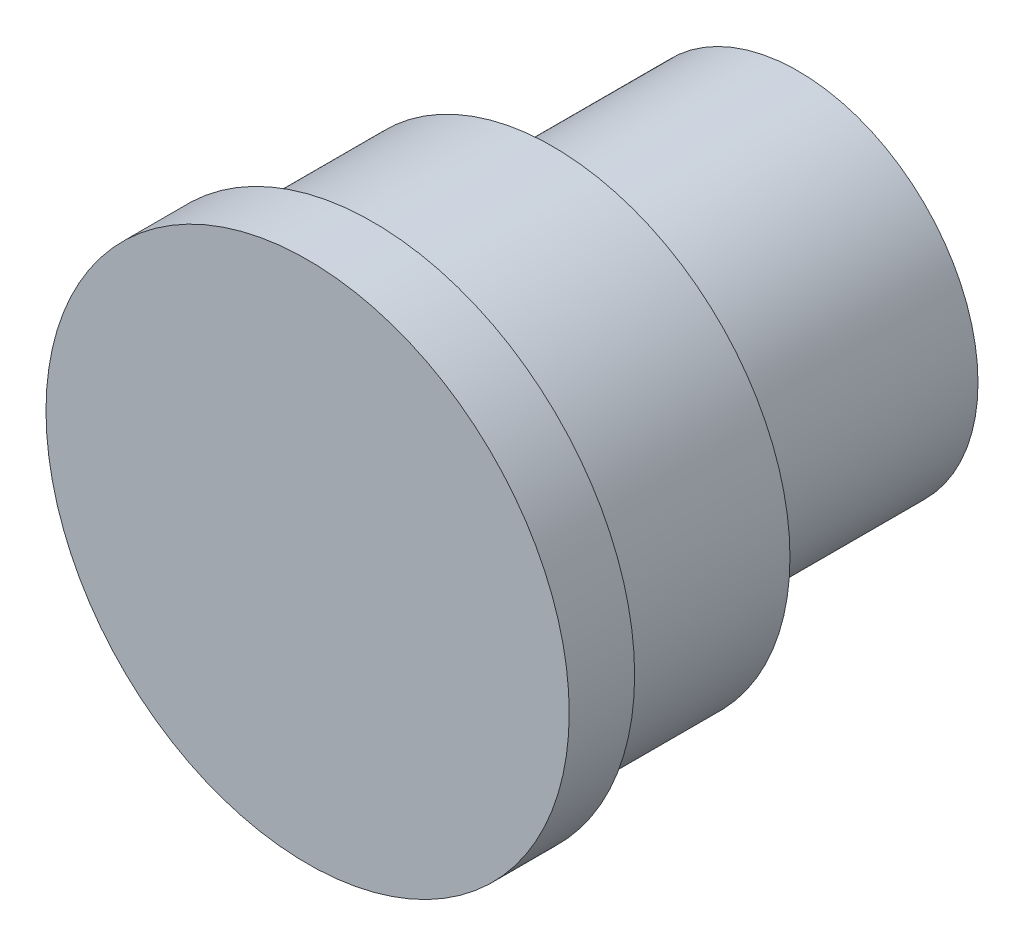
ISO-10303-21;
HEADER;
FILE_DESCRIPTION(('STEP AP214'),'2;1');
FILE_NAME('part.step','',(''),(''),'','','');
FILE_SCHEMA(('AUTOMOTIVE_DESIGN { 1 0 10303 214 1 1 1 1 }'));
ENDSEC;
DATA;
#1=APPLICATION_CONTEXT('core data for automotive mechanical design processes');
#2=APPLICATION_PROTOCOL_DEFINITION('international standard','automotive_design',2000,#1);
#3=PRODUCT_CONTEXT('',#1,'mechanical');
#4=PRODUCT('Part','Part','',(#3));
#5=PRODUCT_RELATED_PRODUCT_CATEGORY('part','',(#4));
#6=PRODUCT_DEFINITION_FORMATION('','',#4);
#7=PRODUCT_DEFINITION_CONTEXT('part definition',#1,'design');
#8=PRODUCT_DEFINITION('design','',#6,#7);
#9=PRODUCT_DEFINITION_SHAPE('','',#8);
#10=(LENGTH_UNIT() NAMED_UNIT(*) SI_UNIT(.MILLI.,.METRE.));
#11=(NAMED_UNIT(*) PLANE_ANGLE_UNIT() SI_UNIT($,.RADIAN.));
#12=(NAMED_UNIT(*) SI_UNIT($,.STERADIAN.) SOLID_ANGLE_UNIT());
#13=UNCERTAINTY_MEASURE_WITH_UNIT(LENGTH_MEASURE(1.E-05),#10,'distance_accuracy_value','');
#14=(GEOMETRIC_REPRESENTATION_CONTEXT(3) GLOBAL_UNCERTAINTY_ASSIGNED_CONTEXT((#13)) GLOBAL_UNIT_ASSIGNED_CONTEXT((#10,
#11,#12)) REPRESENTATION_CONTEXT('',''));
#15=CARTESIAN_POINT('',(0.,0.,0.));
#16=DIRECTION('',(0.,0.,1.));
#17=DIRECTION('',(1.,0.,0.));
#18=AXIS2_PLACEMENT_3D('',#15,#16,#17);
#19=CARTESIAN_POINT('',(0.,0.,15.));
#20=DIRECTION('',(0.,0.,-1.));
#21=DIRECTION('',(-1.,0.,0.));
#22=AXIS2_PLACEMENT_3D('',#19,#20,#21);
#23=CYLINDRICAL_SURFACE('',#22,11.);
#24=CARTESIAN_POINT('',(0.,0.,15.));
#25=DIRECTION('',(0.,0.,1.));
#26=DIRECTION('',(1.,0.,0.));
#27=AXIS2_PLACEMENT_3D('',#24,#25,#26);
#28=CIRCLE('',#27,11.);
#29=CARTESIAN_POINT('',(11.,0.,15.));
#30=VERTEX_POINT('',#29);
#31=EDGE_CURVE('E10',#30,#30,#28,.T.);
#32=ORIENTED_EDGE('',*,*,#31,.F.);
#33=EDGE_LOOP('',(#32));
#34=FACE_BOUND('',#33,.T.);
#35=CARTESIAN_POINT('',(0.,0.,0.));
#36=DIRECTION('',(0.,0.,1.));
#37=DIRECTION('',(1.,0.,0.));
#38=AXIS2_PLACEMENT_3D('',#35,#36,#37);
#39=CIRCLE('',#38,11.);
#40=CARTESIAN_POINT('',(11.,0.,0.));
#41=VERTEX_POINT('',#40);
#42=EDGE_CURVE('E38',#41,#41,#39,.T.);
#43=ORIENTED_EDGE('',*,*,#42,.T.);
#44=EDGE_LOOP('',(#43));
#45=FACE_BOUND('',#44,.T.);
#46=ADVANCED_FACE('F35',(#34,#45),#23,.T.);
#47=CARTESIAN_POINT('',(0.,0.,0.));
#48=DIRECTION('',(0.,0.,1.));
#49=DIRECTION('',(1.,0.,0.));
#50=AXIS2_PLACEMENT_3D('',#47,#48,#49);
#51=PLANE('',#50);
#52=ORIENTED_EDGE('',*,*,#42,.F.);
#53=EDGE_LOOP('',(#52));
#54=FACE_BOUND('',#53,.T.);
#55=ADVANCED_FACE('F77',(#54),#51,.F.);
#56=CARTESIAN_POINT('',(0.,0.,26.));
#57=DIRECTION('',(0.,0.,-1.));
#58=DIRECTION('',(-1.,0.,0.));
#59=AXIS2_PLACEMENT_3D('',#56,#57,#58);
#60=CYLINDRICAL_SURFACE('',#59,14.5);
#61=CARTESIAN_POINT('',(0.,0.,26.));
#62=DIRECTION('',(0.,0.,1.));
#63=DIRECTION('',(1.,0.,0.));
#64=AXIS2_PLACEMENT_3D('',#61,#62,#63);
#65=CIRCLE('',#64,14.5);
#66=CARTESIAN_POINT('',(14.5,0.,26.));
#67=VERTEX_POINT('',#66);
#68=EDGE_CURVE('E45',#67,#67,#65,.T.);
#69=ORIENTED_EDGE('',*,*,#68,.F.);
#70=EDGE_LOOP('',(#69));
#71=FACE_BOUND('',#70,.T.);
#72=CARTESIAN_POINT('',(0.,0.,15.));
#73=DIRECTION('',(0.,0.,1.));
#74=DIRECTION('',(1.,0.,0.));
#75=AXIS2_PLACEMENT_3D('',#72,#73,#74);
#76=CIRCLE('',#75,14.5);
#77=CARTESIAN_POINT('',(14.5,0.,15.));
#78=VERTEX_POINT('',#77);
#79=EDGE_CURVE('E47',#78,#78,#76,.T.);
#80=ORIENTED_EDGE('',*,*,#79,.T.);
#81=EDGE_LOOP('',(#80));
#82=FACE_BOUND('',#81,.T.);
#83=ADVANCED_FACE('F82',(#71,#82),#60,.T.);
#84=CARTESIAN_POINT('',(0.,0.,15.));
#85=DIRECTION('',(0.,0.,1.));
#86=DIRECTION('',(1.,0.,0.));
#87=AXIS2_PLACEMENT_3D('',#84,#85,#86);
#88=PLANE('',#87);
#89=ORIENTED_EDGE('',*,*,#31,.T.);
#90=EDGE_LOOP('',(#89));
#91=FACE_BOUND('',#90,.T.);
#92=ORIENTED_EDGE('',*,*,#79,.F.);
#93=EDGE_LOOP('',(#92));
#94=FACE_BOUND('',#93,.T.);
#95=ADVANCED_FACE('F64',(#91,#94),#88,.F.);
#96=CARTESIAN_POINT('',(0.,0.,30.));
#97=DIRECTION('',(0.,0.,-1.));
#98=DIRECTION('',(-1.,0.,0.));
#99=AXIS2_PLACEMENT_3D('',#96,#97,#98);
#100=CYLINDRICAL_SURFACE('',#99,16.);
#101=CARTESIAN_POINT('',(0.,0.,30.));
#102=DIRECTION('',(0.,0.,1.));
#103=DIRECTION('',(1.,0.,0.));
#104=AXIS2_PLACEMENT_3D('',#101,#102,#103);
#105=CIRCLE('',#104,16.);
#106=CARTESIAN_POINT('',(16.,0.,30.));
#107=VERTEX_POINT('',#106);
#108=EDGE_CURVE('E50',#107,#107,#105,.T.);
#109=ORIENTED_EDGE('',*,*,#108,.F.);
#110=EDGE_LOOP('',(#109));
#111=FACE_BOUND('',#110,.T.);
#112=CARTESIAN_POINT('',(0.,0.,26.));
#113=DIRECTION('',(0.,0.,1.));
#114=DIRECTION('',(1.,0.,0.));
#115=AXIS2_PLACEMENT_3D('',#112,#113,#114);
#116=CIRCLE('',#115,16.);
#117=CARTESIAN_POINT('',(16.,0.,26.));
#118=VERTEX_POINT('',#117);
#119=EDGE_CURVE('E53',#118,#118,#116,.T.);
#120=ORIENTED_EDGE('',*,*,#119,.T.);
#121=EDGE_LOOP('',(#120));
#122=FACE_BOUND('',#121,.T.);
#123=ADVANCED_FACE('F61',(#111,#122),#100,.T.);
#124=CARTESIAN_POINT('',(0.,0.,30.));
#125=DIRECTION('',(0.,0.,1.));
#126=DIRECTION('',(1.,0.,0.));
#127=AXIS2_PLACEMENT_3D('',#124,#125,#126);
#128=PLANE('',#127);
#129=ORIENTED_EDGE('',*,*,#108,.T.);
#130=EDGE_LOOP('',(#129));
#131=FACE_BOUND('',#130,.T.);
#132=ADVANCED_FACE('F59',(#131),#128,.T.);
#133=CARTESIAN_POINT('',(0.,0.,26.));
#134=DIRECTION('',(0.,0.,1.));
#135=DIRECTION('',(1.,0.,0.));
#136=AXIS2_PLACEMENT_3D('',#133,#134,#135);
#137=PLANE('',#136);
#138=ORIENTED_EDGE('',*,*,#68,.T.);
#139=EDGE_LOOP('',(#138));
#140=FACE_BOUND('',#139,.T.);
#141=ORIENTED_EDGE('',*,*,#119,.F.);
#142=EDGE_LOOP('',(#141));
#143=FACE_BOUND('',#142,.T.);
#144=ADVANCED_FACE('F68',(#140,#143),#137,.F.);
#145=CLOSED_SHELL('',(#46,#55,#83,#95,#123,#132,#144));
#146=MANIFOLD_SOLID_BREP('B2',#145);
#147=ADVANCED_BREP_SHAPE_REPRESENTATION('',(#18,#146),#14);
#148=SHAPE_DEFINITION_REPRESENTATION(#9,#147);
ENDSEC;
END-ISO-10303-21;
